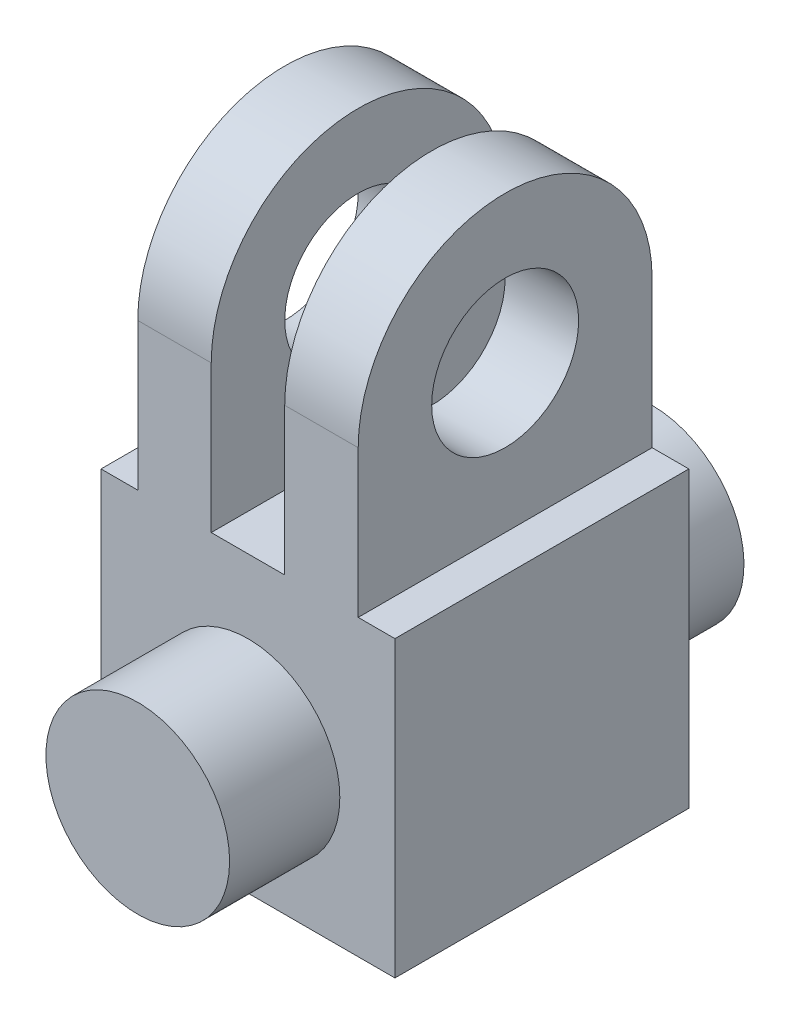
ISO-10303-21;
HEADER;
FILE_DESCRIPTION(('STEP AP214'),'2;1');
FILE_NAME('part.step','',(''),(''),'','','');
FILE_SCHEMA(('AUTOMOTIVE_DESIGN { 1 0 10303 214 1 1 1 1 }'));
ENDSEC;
DATA;
#1=APPLICATION_CONTEXT('core data for automotive mechanical design processes');
#2=APPLICATION_PROTOCOL_DEFINITION('international standard','automotive_design',2000,#1);
#3=PRODUCT_CONTEXT('',#1,'mechanical');
#4=PRODUCT('Part','Part','',(#3));
#5=PRODUCT_RELATED_PRODUCT_CATEGORY('part','',(#4));
#6=PRODUCT_DEFINITION_FORMATION('','',#4);
#7=PRODUCT_DEFINITION_CONTEXT('part definition',#1,'design');
#8=PRODUCT_DEFINITION('design','',#6,#7);
#9=PRODUCT_DEFINITION_SHAPE('','',#8);
#10=(LENGTH_UNIT() NAMED_UNIT(*) SI_UNIT(.MILLI.,.METRE.));
#11=(NAMED_UNIT(*) PLANE_ANGLE_UNIT() SI_UNIT($,.RADIAN.));
#12=(NAMED_UNIT(*) SI_UNIT($,.STERADIAN.) SOLID_ANGLE_UNIT());
#13=UNCERTAINTY_MEASURE_WITH_UNIT(LENGTH_MEASURE(1.E-05),#10,'distance_accuracy_value','');
#14=(GEOMETRIC_REPRESENTATION_CONTEXT(3) GLOBAL_UNCERTAINTY_ASSIGNED_CONTEXT((#13)) GLOBAL_UNIT_ASSIGNED_CONTEXT((#10,
#11,#12)) REPRESENTATION_CONTEXT('',''));
#15=CARTESIAN_POINT('',(0.,0.,0.));
#16=DIRECTION('',(0.,0.,1.));
#17=DIRECTION('',(1.,0.,0.));
#18=AXIS2_PLACEMENT_3D('',#15,#16,#17);
#19=CARTESIAN_POINT('',(-80.,120.,-40.));
#20=DIRECTION('',(1.,0.,0.));
#21=DIRECTION('',(0.,0.,-1.));
#22=AXIS2_PLACEMENT_3D('',#19,#20,#21);
#23=CYLINDRICAL_SURFACE('',#22,40.);
#24=CARTESIAN_POINT('',(-9.99999999999999,120.,-40.));
#25=DIRECTION('',(-1.,0.,0.));
#26=DIRECTION('',(0.,0.,1.));
#27=AXIS2_PLACEMENT_3D('',#24,#25,#26);
#28=CIRCLE('',#27,40.);
#29=CARTESIAN_POINT('',(-10.,120.,0.));
#30=VERTEX_POINT('',#29);
#31=CARTESIAN_POINT('',(-10.,120.,-80.));
#32=VERTEX_POINT('',#31);
#33=EDGE_CURVE('E139',#30,#32,#28,.T.);
#34=ORIENTED_EDGE('',*,*,#33,.T.);
#35=DIRECTION('',(1.,0.,0.));
#36=VECTOR('',#35,1.);
#37=CARTESIAN_POINT('',(-80.,120.,-80.));
#38=LINE('',#37,#36);
#39=CARTESIAN_POINT('',(-30.,120.,-80.));
#40=VERTEX_POINT('',#39);
#41=EDGE_CURVE('E223',#40,#32,#38,.T.);
#42=ORIENTED_EDGE('',*,*,#41,.F.);
#43=CARTESIAN_POINT('',(-30.,120.,-40.));
#44=DIRECTION('',(1.,0.,0.));
#45=DIRECTION('',(0.,0.,-1.));
#46=AXIS2_PLACEMENT_3D('',#43,#44,#45);
#47=CIRCLE('',#46,40.);
#48=CARTESIAN_POINT('',(-30.,120.,0.));
#49=VERTEX_POINT('',#48);
#50=EDGE_CURVE('E180',#40,#49,#47,.T.);
#51=ORIENTED_EDGE('',*,*,#50,.T.);
#52=DIRECTION('',(1.,0.,0.));
#53=VECTOR('',#52,1.);
#54=CARTESIAN_POINT('',(-80.,120.,0.));
#55=LINE('',#54,#53);
#56=EDGE_CURVE('E42',#49,#30,#55,.T.);
#57=ORIENTED_EDGE('',*,*,#56,.T.);
#58=EDGE_LOOP('',(#34,#42,#51,#57));
#59=FACE_BOUND('',#58,.T.);
#60=ADVANCED_FACE('F33',(#59),#23,.T.);
#61=CARTESIAN_POINT('',(-80.,120.,0.));
#62=DIRECTION('',(0.,0.,1.));
#63=DIRECTION('',(0.,-1.,0.));
#64=AXIS2_PLACEMENT_3D('',#61,#62,#63);
#65=PLANE('',#64);
#66=CARTESIAN_POINT('',(-40.,35.,0.));
#67=DIRECTION('',(0.,0.,1.));
#68=DIRECTION('',(1.,0.,0.));
#69=AXIS2_PLACEMENT_3D('',#66,#67,#68);
#70=CIRCLE('',#69,25.);
#71=CARTESIAN_POINT('',(-15.,35.,0.));
#72=VERTEX_POINT('',#71);
#73=EDGE_CURVE('E240',#72,#72,#70,.T.);
#74=ORIENTED_EDGE('',*,*,#73,.F.);
#75=EDGE_LOOP('',(#74));
#76=FACE_BOUND('',#75,.T.);
#77=DIRECTION('',(0.,-1.,0.));
#78=VECTOR('',#77,1.);
#79=CARTESIAN_POINT('',(-10.,80.,0.));
#80=LINE('',#79,#78);
#81=CARTESIAN_POINT('',(-10.,80.,0.));
#82=VERTEX_POINT('',#81);
#83=EDGE_CURVE('E136',#30,#82,#80,.T.);
#84=ORIENTED_EDGE('',*,*,#83,.F.);
#85=ORIENTED_EDGE('',*,*,#56,.F.);
#86=DIRECTION('',(0.,1.,0.));
#87=VECTOR('',#86,1.);
#88=CARTESIAN_POINT('',(-30.,80.,0.));
#89=LINE('',#88,#87);
#90=CARTESIAN_POINT('',(-30.,80.,0.));
#91=VERTEX_POINT('',#90);
#92=EDGE_CURVE('E190',#91,#49,#89,.T.);
#93=ORIENTED_EDGE('',*,*,#92,.F.);
#94=DIRECTION('',(1.,0.,0.));
#95=VECTOR('',#94,1.);
#96=CARTESIAN_POINT('',(-50.,80.,0.));
#97=LINE('',#96,#95);
#98=CARTESIAN_POINT('',(-50.,80.,0.));
#99=VERTEX_POINT('',#98);
#100=EDGE_CURVE('E195',#99,#91,#97,.T.);
#101=ORIENTED_EDGE('',*,*,#100,.F.);
#102=DIRECTION('',(0.,-1.,0.));
#103=VECTOR('',#102,1.);
#104=CARTESIAN_POINT('',(-50.,160.,0.));
#105=LINE('',#104,#103);
#106=CARTESIAN_POINT('',(-50.,120.,0.));
#107=VERTEX_POINT('',#106);
#108=EDGE_CURVE('E192',#107,#99,#105,.T.);
#109=ORIENTED_EDGE('',*,*,#108,.F.);
#110=CARTESIAN_POINT('',(-70.,120.,0.));
#111=VERTEX_POINT('',#110);
#112=EDGE_CURVE('E11',#111,#107,#55,.T.);
#113=ORIENTED_EDGE('',*,*,#112,.F.);
#114=DIRECTION('',(0.,1.,0.));
#115=VECTOR('',#114,1.);
#116=CARTESIAN_POINT('',(-70.,80.,0.));
#117=LINE('',#116,#115);
#118=CARTESIAN_POINT('',(-70.,80.,0.));
#119=VERTEX_POINT('',#118);
#120=EDGE_CURVE('E166',#119,#111,#117,.T.);
#121=ORIENTED_EDGE('',*,*,#120,.F.);
#122=DIRECTION('',(1.,0.,0.));
#123=VECTOR('',#122,1.);
#124=CARTESIAN_POINT('',(-80.,80.,0.));
#125=LINE('',#124,#123);
#126=CARTESIAN_POINT('',(-80.,80.,0.));
#127=VERTEX_POINT('',#126);
#128=EDGE_CURVE('E163',#127,#119,#125,.T.);
#129=ORIENTED_EDGE('',*,*,#128,.F.);
#130=DIRECTION('',(0.,-1.,0.));
#131=VECTOR('',#130,1.);
#132=CARTESIAN_POINT('',(-80.,120.,0.));
#133=LINE('',#132,#131);
#134=CARTESIAN_POINT('',(-80.,0.,0.));
#135=VERTEX_POINT('',#134);
#136=EDGE_CURVE('E207',#127,#135,#133,.T.);
#137=ORIENTED_EDGE('',*,*,#136,.T.);
#138=DIRECTION('',(1.,0.,0.));
#139=VECTOR('',#138,1.);
#140=CARTESIAN_POINT('',(-80.,0.,0.));
#141=LINE('',#140,#139);
#142=CARTESIAN_POINT('',(0.,0.,0.));
#143=VERTEX_POINT('',#142);
#144=EDGE_CURVE('E37',#135,#143,#141,.T.);
#145=ORIENTED_EDGE('',*,*,#144,.T.);
#146=DIRECTION('',(0.,-1.,0.));
#147=VECTOR('',#146,1.);
#148=CARTESIAN_POINT('',(0.,120.,0.));
#149=LINE('',#148,#147);
#150=CARTESIAN_POINT('',(0.,80.,0.));
#151=VERTEX_POINT('',#150);
#152=EDGE_CURVE('E146',#151,#143,#149,.T.);
#153=ORIENTED_EDGE('',*,*,#152,.F.);
#154=DIRECTION('',(1.,0.,0.));
#155=VECTOR('',#154,1.);
#156=CARTESIAN_POINT('',(0.,80.,0.));
#157=LINE('',#156,#155);
#158=EDGE_CURVE('E127',#82,#151,#157,.T.);
#159=ORIENTED_EDGE('',*,*,#158,.F.);
#160=EDGE_LOOP('',(#84,#85,#93,#101,#109,#113,#121,#129,#137,#145,#153,#159));
#161=FACE_BOUND('',#160,.T.);
#162=ADVANCED_FACE('F35',(#76,#161),#65,.T.);
#163=CARTESIAN_POINT('',(-70.,120.,-40.));
#164=DIRECTION('',(1.,0.,0.));
#165=DIRECTION('',(0.,0.,-1.));
#166=AXIS2_PLACEMENT_3D('',#163,#164,#165);
#167=CIRCLE('',#166,40.);
#168=CARTESIAN_POINT('',(-70.,120.,-80.));
#169=VERTEX_POINT('',#168);
#170=EDGE_CURVE('E156',#169,#111,#167,.T.);
#171=ORIENTED_EDGE('',*,*,#170,.T.);
#172=ORIENTED_EDGE('',*,*,#112,.T.);
#173=CARTESIAN_POINT('',(-50.,120.,-40.));
#174=DIRECTION('',(-1.,0.,0.));
#175=DIRECTION('',(0.,-1.,0.));
#176=AXIS2_PLACEMENT_3D('',#173,#174,#175);
#177=CIRCLE('',#176,40.);
#178=CARTESIAN_POINT('',(-50.,120.,-80.));
#179=VERTEX_POINT('',#178);
#180=EDGE_CURVE('E176',#107,#179,#177,.T.);
#181=ORIENTED_EDGE('',*,*,#180,.T.);
#182=EDGE_CURVE('E222',#169,#179,#38,.T.);
#183=ORIENTED_EDGE('',*,*,#182,.F.);
#184=EDGE_LOOP('',(#171,#172,#181,#183));
#185=FACE_BOUND('',#184,.T.);
#186=ADVANCED_FACE('F262',(#185),#23,.T.);
#187=CARTESIAN_POINT('',(-80.,0.,-80.));
#188=DIRECTION('',(0.,0.,-1.));
#189=DIRECTION('',(0.,1.,0.));
#190=AXIS2_PLACEMENT_3D('',#187,#188,#189);
#191=PLANE('',#190);
#192=CARTESIAN_POINT('',(-40.,35.,-80.));
#193=DIRECTION('',(0.,0.,-1.));
#194=DIRECTION('',(0.,1.,0.));
#195=AXIS2_PLACEMENT_3D('',#192,#193,#194);
#196=CIRCLE('',#195,25.);
#197=CARTESIAN_POINT('',(-40.,60.,-80.));
#198=VERTEX_POINT('',#197);
#199=EDGE_CURVE('E246',#198,#198,#196,.T.);
#200=ORIENTED_EDGE('',*,*,#199,.F.);
#201=EDGE_LOOP('',(#200));
#202=FACE_BOUND('',#201,.T.);
#203=DIRECTION('',(0.,-1.,0.));
#204=VECTOR('',#203,1.);
#205=CARTESIAN_POINT('',(-10.,80.,-80.));
#206=LINE('',#205,#204);
#207=CARTESIAN_POINT('',(-10.,80.,-80.));
#208=VERTEX_POINT('',#207);
#209=EDGE_CURVE('E154',#32,#208,#206,.T.);
#210=ORIENTED_EDGE('',*,*,#209,.T.);
#211=DIRECTION('',(1.,0.,0.));
#212=VECTOR('',#211,1.);
#213=CARTESIAN_POINT('',(0.,80.,-80.));
#214=LINE('',#213,#212);
#215=CARTESIAN_POINT('',(0.,80.,-80.));
#216=VERTEX_POINT('',#215);
#217=EDGE_CURVE('E130',#208,#216,#214,.T.);
#218=ORIENTED_EDGE('',*,*,#217,.T.);
#219=DIRECTION('',(0.,1.,0.));
#220=VECTOR('',#219,1.);
#221=CARTESIAN_POINT('',(0.,0.,-80.));
#222=LINE('',#221,#220);
#223=CARTESIAN_POINT('',(0.,0.,-80.));
#224=VERTEX_POINT('',#223);
#225=EDGE_CURVE('E210',#224,#216,#222,.T.);
#226=ORIENTED_EDGE('',*,*,#225,.F.);
#227=DIRECTION('',(1.,0.,0.));
#228=VECTOR('',#227,1.);
#229=CARTESIAN_POINT('',(-80.,0.,-80.));
#230=LINE('',#229,#228);
#231=CARTESIAN_POINT('',(-80.,0.,-80.));
#232=VERTEX_POINT('',#231);
#233=EDGE_CURVE('E225',#232,#224,#230,.T.);
#234=ORIENTED_EDGE('',*,*,#233,.F.);
#235=DIRECTION('',(0.,1.,0.));
#236=VECTOR('',#235,1.);
#237=CARTESIAN_POINT('',(-80.,0.,-80.));
#238=LINE('',#237,#236);
#239=CARTESIAN_POINT('',(-80.,80.,-80.));
#240=VERTEX_POINT('',#239);
#241=EDGE_CURVE('E213',#232,#240,#238,.T.);
#242=ORIENTED_EDGE('',*,*,#241,.T.);
#243=DIRECTION('',(1.,0.,0.));
#244=VECTOR('',#243,1.);
#245=CARTESIAN_POINT('',(-80.,80.,-80.));
#246=LINE('',#245,#244);
#247=CARTESIAN_POINT('',(-70.,80.,-80.));
#248=VERTEX_POINT('',#247);
#249=EDGE_CURVE('E58',#240,#248,#246,.T.);
#250=ORIENTED_EDGE('',*,*,#249,.T.);
#251=DIRECTION('',(0.,1.,0.));
#252=VECTOR('',#251,1.);
#253=CARTESIAN_POINT('',(-70.,80.,-80.));
#254=LINE('',#253,#252);
#255=EDGE_CURVE('E159',#248,#169,#254,.T.);
#256=ORIENTED_EDGE('',*,*,#255,.T.);
#257=ORIENTED_EDGE('',*,*,#182,.T.);
#258=DIRECTION('',(0.,-1.,0.));
#259=VECTOR('',#258,1.);
#260=CARTESIAN_POINT('',(-50.,160.,-80.));
#261=LINE('',#260,#259);
#262=CARTESIAN_POINT('',(-50.,80.,-80.));
#263=VERTEX_POINT('',#262);
#264=EDGE_CURVE('E186',#179,#263,#261,.T.);
#265=ORIENTED_EDGE('',*,*,#264,.T.);
#266=DIRECTION('',(1.,0.,0.));
#267=VECTOR('',#266,1.);
#268=CARTESIAN_POINT('',(-50.,80.,-80.));
#269=LINE('',#268,#267);
#270=CARTESIAN_POINT('',(-30.,80.,-80.));
#271=VERTEX_POINT('',#270);
#272=EDGE_CURVE('E179',#263,#271,#269,.T.);
#273=ORIENTED_EDGE('',*,*,#272,.T.);
#274=DIRECTION('',(0.,1.,0.));
#275=VECTOR('',#274,1.);
#276=CARTESIAN_POINT('',(-30.,80.,-80.));
#277=LINE('',#276,#275);
#278=EDGE_CURVE('E50',#271,#40,#277,.T.);
#279=ORIENTED_EDGE('',*,*,#278,.T.);
#280=ORIENTED_EDGE('',*,*,#41,.T.);
#281=EDGE_LOOP('',(#210,#218,#226,#234,#242,#250,#256,#257,#265,#273,#279,#280));
#282=FACE_BOUND('',#281,.T.);
#283=ADVANCED_FACE('F237',(#202,#282),#191,.T.);
#284=CARTESIAN_POINT('',(-80.,0.,0.));
#285=DIRECTION('',(0.,-1.,0.));
#286=DIRECTION('',(0.,0.,-1.));
#287=AXIS2_PLACEMENT_3D('',#284,#285,#286);
#288=PLANE('',#287);
#289=DIRECTION('',(0.,0.,-1.));
#290=VECTOR('',#289,1.);
#291=CARTESIAN_POINT('',(0.,0.,0.));
#292=LINE('',#291,#290);
#293=EDGE_CURVE('E217',#143,#224,#292,.T.);
#294=ORIENTED_EDGE('',*,*,#293,.F.);
#295=ORIENTED_EDGE('',*,*,#144,.F.);
#296=DIRECTION('',(0.,0.,-1.));
#297=VECTOR('',#296,1.);
#298=CARTESIAN_POINT('',(-80.,0.,0.));
#299=LINE('',#298,#297);
#300=EDGE_CURVE('E209',#135,#232,#299,.T.);
#301=ORIENTED_EDGE('',*,*,#300,.T.);
#302=ORIENTED_EDGE('',*,*,#233,.T.);
#303=EDGE_LOOP('',(#294,#295,#301,#302));
#304=FACE_BOUND('',#303,.T.);
#305=ADVANCED_FACE('F233',(#304),#288,.T.);
#306=CARTESIAN_POINT('',(-80.,120.,-40.));
#307=DIRECTION('',(1.,0.,0.));
#308=DIRECTION('',(0.,0.,-1.));
#309=AXIS2_PLACEMENT_3D('',#306,#307,#308);
#310=PLANE('',#309);
#311=ORIENTED_EDGE('',*,*,#136,.F.);
#312=DIRECTION('',(0.,0.,1.));
#313=VECTOR('',#312,1.);
#314=CARTESIAN_POINT('',(-80.,80.,-80.001));
#315=LINE('',#314,#313);
#316=EDGE_CURVE('E168',#240,#127,#315,.T.);
#317=ORIENTED_EDGE('',*,*,#316,.F.);
#318=ORIENTED_EDGE('',*,*,#241,.F.);
#319=ORIENTED_EDGE('',*,*,#300,.F.);
#320=EDGE_LOOP('',(#311,#317,#318,#319));
#321=FACE_BOUND('',#320,.T.);
#322=ADVANCED_FACE('F268',(#321),#310,.F.);
#323=CARTESIAN_POINT('',(0.,120.,-40.));
#324=DIRECTION('',(1.,0.,0.));
#325=DIRECTION('',(0.,0.,-1.));
#326=AXIS2_PLACEMENT_3D('',#323,#324,#325);
#327=PLANE('',#326);
#328=DIRECTION('',(0.,0.,1.));
#329=VECTOR('',#328,1.);
#330=CARTESIAN_POINT('',(0.,80.,-80.001));
#331=LINE('',#330,#329);
#332=EDGE_CURVE('E133',#216,#151,#331,.T.);
#333=ORIENTED_EDGE('',*,*,#332,.T.);
#334=ORIENTED_EDGE('',*,*,#152,.T.);
#335=ORIENTED_EDGE('',*,*,#293,.T.);
#336=ORIENTED_EDGE('',*,*,#225,.T.);
#337=EDGE_LOOP('',(#333,#334,#335,#336));
#338=FACE_BOUND('',#337,.T.);
#339=ADVANCED_FACE('F235',(#338),#327,.T.);
#340=CARTESIAN_POINT('',(-30.,80.,-80.001));
#341=DIRECTION('',(1.,0.,0.));
#342=DIRECTION('',(0.,0.,-1.));
#343=AXIS2_PLACEMENT_3D('',#340,#341,#342);
#344=PLANE('',#343);
#345=CARTESIAN_POINT('',(-30.,120.,-40.));
#346=DIRECTION('',(1.,0.,0.));
#347=DIRECTION('',(0.,0.,-1.));
#348=AXIS2_PLACEMENT_3D('',#345,#346,#347);
#349=CIRCLE('',#348,20.);
#350=CARTESIAN_POINT('',(-30.,120.,-60.));
#351=VERTEX_POINT('',#350);
#352=EDGE_CURVE('E160',#351,#351,#349,.T.);
#353=ORIENTED_EDGE('',*,*,#352,.T.);
#354=EDGE_LOOP('',(#353));
#355=FACE_BOUND('',#354,.T.);
#356=ORIENTED_EDGE('',*,*,#50,.F.);
#357=ORIENTED_EDGE('',*,*,#278,.F.);
#358=DIRECTION('',(0.,0.,1.));
#359=VECTOR('',#358,1.);
#360=CARTESIAN_POINT('',(-30.,80.,-80.001));
#361=LINE('',#360,#359);
#362=EDGE_CURVE('E199',#271,#91,#361,.T.);
#363=ORIENTED_EDGE('',*,*,#362,.T.);
#364=ORIENTED_EDGE('',*,*,#92,.T.);
#365=EDGE_LOOP('',(#356,#357,#363,#364));
#366=FACE_BOUND('',#365,.T.);
#367=ADVANCED_FACE('F280',(#355,#366),#344,.F.);
#368=CARTESIAN_POINT('',(-50.,160.,-80.001));
#369=DIRECTION('',(-1.,0.,0.));
#370=DIRECTION('',(0.,-1.,0.));
#371=AXIS2_PLACEMENT_3D('',#368,#369,#370);
#372=PLANE('',#371);
#373=CARTESIAN_POINT('',(-50.,120.,-40.));
#374=DIRECTION('',(-1.,0.,0.));
#375=DIRECTION('',(0.,-1.,0.));
#376=AXIS2_PLACEMENT_3D('',#373,#374,#375);
#377=CIRCLE('',#376,20.);
#378=CARTESIAN_POINT('',(-50.,100.,-40.));
#379=VERTEX_POINT('',#378);
#380=EDGE_CURVE('E201',#379,#379,#377,.T.);
#381=ORIENTED_EDGE('',*,*,#380,.T.);
#382=EDGE_LOOP('',(#381));
#383=FACE_BOUND('',#382,.T.);
#384=ORIENTED_EDGE('',*,*,#108,.T.);
#385=DIRECTION('',(0.,0.,1.));
#386=VECTOR('',#385,1.);
#387=CARTESIAN_POINT('',(-50.,80.,-80.001));
#388=LINE('',#387,#386);
#389=EDGE_CURVE('E198',#263,#99,#388,.T.);
#390=ORIENTED_EDGE('',*,*,#389,.F.);
#391=ORIENTED_EDGE('',*,*,#264,.F.);
#392=ORIENTED_EDGE('',*,*,#180,.F.);
#393=EDGE_LOOP('',(#384,#390,#391,#392));
#394=FACE_BOUND('',#393,.T.);
#395=ADVANCED_FACE('F292',(#383,#394),#372,.F.);
#396=CARTESIAN_POINT('',(-50.,80.,-80.001));
#397=DIRECTION('',(0.,-1.,0.));
#398=DIRECTION('',(0.,0.,-1.));
#399=AXIS2_PLACEMENT_3D('',#396,#397,#398);
#400=PLANE('',#399);
#401=ORIENTED_EDGE('',*,*,#389,.T.);
#402=ORIENTED_EDGE('',*,*,#100,.T.);
#403=ORIENTED_EDGE('',*,*,#362,.F.);
#404=ORIENTED_EDGE('',*,*,#272,.F.);
#405=EDGE_LOOP('',(#401,#402,#403,#404));
#406=FACE_BOUND('',#405,.T.);
#407=ADVANCED_FACE('F296',(#406),#400,.F.);
#408=CARTESIAN_POINT('',(-80.,120.,-40.));
#409=DIRECTION('',(1.,0.,0.));
#410=DIRECTION('',(0.,0.,-1.));
#411=AXIS2_PLACEMENT_3D('',#408,#409,#410);
#412=CYLINDRICAL_SURFACE('',#411,20.);
#413=CARTESIAN_POINT('',(-9.99999999999999,120.,-40.));
#414=DIRECTION('',(-1.,0.,0.));
#415=DIRECTION('',(0.,0.,1.));
#416=AXIS2_PLACEMENT_3D('',#413,#414,#415);
#417=CIRCLE('',#416,20.);
#418=CARTESIAN_POINT('',(-9.99999999999999,120.,-20.));
#419=VERTEX_POINT('',#418);
#420=EDGE_CURVE('E150',#419,#419,#417,.T.);
#421=ORIENTED_EDGE('',*,*,#420,.F.);
#422=EDGE_LOOP('',(#421));
#423=FACE_BOUND('',#422,.T.);
#424=ORIENTED_EDGE('',*,*,#352,.F.);
#425=EDGE_LOOP('',(#424));
#426=FACE_BOUND('',#425,.T.);
#427=ADVANCED_FACE('F289',(#423,#426),#412,.F.);
#428=CARTESIAN_POINT('',(-70.,80.,-80.001));
#429=DIRECTION('',(1.,0.,0.));
#430=DIRECTION('',(0.,0.,-1.));
#431=AXIS2_PLACEMENT_3D('',#428,#429,#430);
#432=PLANE('',#431);
#433=CARTESIAN_POINT('',(-70.,120.,-40.));
#434=DIRECTION('',(1.,0.,0.));
#435=DIRECTION('',(0.,0.,-1.));
#436=AXIS2_PLACEMENT_3D('',#433,#434,#435);
#437=CIRCLE('',#436,20.);
#438=CARTESIAN_POINT('',(-70.,120.,-60.));
#439=VERTEX_POINT('',#438);
#440=EDGE_CURVE('E173',#439,#439,#437,.T.);
#441=ORIENTED_EDGE('',*,*,#440,.T.);
#442=EDGE_LOOP('',(#441));
#443=FACE_BOUND('',#442,.T.);
#444=ORIENTED_EDGE('',*,*,#170,.F.);
#445=ORIENTED_EDGE('',*,*,#255,.F.);
#446=DIRECTION('',(0.,0.,1.));
#447=VECTOR('',#446,1.);
#448=CARTESIAN_POINT('',(-70.,80.,-80.001));
#449=LINE('',#448,#447);
#450=EDGE_CURVE('E169',#248,#119,#449,.T.);
#451=ORIENTED_EDGE('',*,*,#450,.T.);
#452=ORIENTED_EDGE('',*,*,#120,.T.);
#453=EDGE_LOOP('',(#444,#445,#451,#452));
#454=FACE_BOUND('',#453,.T.);
#455=ADVANCED_FACE('F304',(#443,#454),#432,.F.);
#456=CARTESIAN_POINT('',(-80.,80.,-80.001));
#457=DIRECTION('',(0.,-1.,0.));
#458=DIRECTION('',(0.,0.,-1.));
#459=AXIS2_PLACEMENT_3D('',#456,#457,#458);
#460=PLANE('',#459);
#461=ORIENTED_EDGE('',*,*,#316,.T.);
#462=ORIENTED_EDGE('',*,*,#128,.T.);
#463=ORIENTED_EDGE('',*,*,#450,.F.);
#464=ORIENTED_EDGE('',*,*,#249,.F.);
#465=EDGE_LOOP('',(#461,#462,#463,#464));
#466=FACE_BOUND('',#465,.T.);
#467=ADVANCED_FACE('F301',(#466),#460,.F.);
#468=CARTESIAN_POINT('',(-10.,80.,-80.001));
#469=DIRECTION('',(-1.,0.,0.));
#470=DIRECTION('',(0.,0.,1.));
#471=AXIS2_PLACEMENT_3D('',#468,#469,#470);
#472=PLANE('',#471);
#473=ORIENTED_EDGE('',*,*,#420,.T.);
#474=EDGE_LOOP('',(#473));
#475=FACE_BOUND('',#474,.T.);
#476=ORIENTED_EDGE('',*,*,#83,.T.);
#477=DIRECTION('',(0.,0.,1.));
#478=VECTOR('',#477,1.);
#479=CARTESIAN_POINT('',(-10.,80.,-80.001));
#480=LINE('',#479,#478);
#481=EDGE_CURVE('E123',#208,#82,#480,.T.);
#482=ORIENTED_EDGE('',*,*,#481,.F.);
#483=ORIENTED_EDGE('',*,*,#209,.F.);
#484=ORIENTED_EDGE('',*,*,#33,.F.);
#485=EDGE_LOOP('',(#476,#482,#483,#484));
#486=FACE_BOUND('',#485,.T.);
#487=ADVANCED_FACE('F137',(#475,#486),#472,.F.);
#488=CARTESIAN_POINT('',(0.,80.,-80.001));
#489=DIRECTION('',(0.,-1.,0.));
#490=DIRECTION('',(0.,0.,-1.));
#491=AXIS2_PLACEMENT_3D('',#488,#489,#490);
#492=PLANE('',#491);
#493=ORIENTED_EDGE('',*,*,#481,.T.);
#494=ORIENTED_EDGE('',*,*,#158,.T.);
#495=ORIENTED_EDGE('',*,*,#332,.F.);
#496=ORIENTED_EDGE('',*,*,#217,.F.);
#497=EDGE_LOOP('',(#493,#494,#495,#496));
#498=FACE_BOUND('',#497,.T.);
#499=ADVANCED_FACE('F125',(#498),#492,.F.);
#500=ORIENTED_EDGE('',*,*,#440,.F.);
#501=EDGE_LOOP('',(#500));
#502=FACE_BOUND('',#501,.T.);
#503=ORIENTED_EDGE('',*,*,#380,.F.);
#504=EDGE_LOOP('',(#503));
#505=FACE_BOUND('',#504,.T.);
#506=ADVANCED_FACE('F284',(#502,#505),#412,.F.);
#507=CARTESIAN_POINT('',(-40.,35.,30.));
#508=DIRECTION('',(0.,0.,-1.));
#509=DIRECTION('',(-1.,0.,0.));
#510=AXIS2_PLACEMENT_3D('',#507,#508,#509);
#511=CYLINDRICAL_SURFACE('',#510,25.);
#512=CARTESIAN_POINT('',(-40.,35.,30.));
#513=DIRECTION('',(0.,0.,1.));
#514=DIRECTION('',(1.,0.,0.));
#515=AXIS2_PLACEMENT_3D('',#512,#513,#514);
#516=CIRCLE('',#515,25.);
#517=CARTESIAN_POINT('',(-15.,35.,30.));
#518=VERTEX_POINT('',#517);
#519=EDGE_CURVE('E183',#518,#518,#516,.T.);
#520=ORIENTED_EDGE('',*,*,#519,.F.);
#521=EDGE_LOOP('',(#520));
#522=FACE_BOUND('',#521,.T.);
#523=ORIENTED_EDGE('',*,*,#73,.T.);
#524=EDGE_LOOP('',(#523));
#525=FACE_BOUND('',#524,.T.);
#526=ADVANCED_FACE('F287',(#522,#525),#511,.T.);
#527=CARTESIAN_POINT('',(-40.,35.,30.));
#528=DIRECTION('',(0.,0.,1.));
#529=DIRECTION('',(1.,0.,0.));
#530=AXIS2_PLACEMENT_3D('',#527,#528,#529);
#531=PLANE('',#530);
#532=ORIENTED_EDGE('',*,*,#519,.T.);
#533=EDGE_LOOP('',(#532));
#534=FACE_BOUND('',#533,.T.);
#535=ADVANCED_FACE('F257',(#534),#531,.T.);
#536=CARTESIAN_POINT('',(-40.,35.,-110.));
#537=DIRECTION('',(0.,0.,1.));
#538=DIRECTION('',(0.,-1.,0.));
#539=AXIS2_PLACEMENT_3D('',#536,#537,#538);
#540=CYLINDRICAL_SURFACE('',#539,25.);
#541=CARTESIAN_POINT('',(-40.,35.,-110.));
#542=DIRECTION('',(0.,0.,-1.));
#543=DIRECTION('',(0.,1.,0.));
#544=AXIS2_PLACEMENT_3D('',#541,#542,#543);
#545=CIRCLE('',#544,25.);
#546=CARTESIAN_POINT('',(-40.,60.,-110.));
#547=VERTEX_POINT('',#546);
#548=EDGE_CURVE('E243',#547,#547,#545,.T.);
#549=ORIENTED_EDGE('',*,*,#548,.F.);
#550=EDGE_LOOP('',(#549));
#551=FACE_BOUND('',#550,.T.);
#552=ORIENTED_EDGE('',*,*,#199,.T.);
#553=EDGE_LOOP('',(#552));
#554=FACE_BOUND('',#553,.T.);
#555=ADVANCED_FACE('F254',(#551,#554),#540,.T.);
#556=CARTESIAN_POINT('',(-40.,35.,-110.));
#557=DIRECTION('',(0.,0.,-1.));
#558=DIRECTION('',(0.,1.,0.));
#559=AXIS2_PLACEMENT_3D('',#556,#557,#558);
#560=PLANE('',#559);
#561=ORIENTED_EDGE('',*,*,#548,.T.);
#562=EDGE_LOOP('',(#561));
#563=FACE_BOUND('',#562,.T.);
#564=ADVANCED_FACE('F252',(#563),#560,.T.);
#565=CLOSED_SHELL('',(#60,#162,#186,#283,#305,#322,#339,#367,#395,#407,#427,#455,#467,#487,#499,
#506,#526,#535,#555,#564));
#566=MANIFOLD_SOLID_BREP('B2',#565);
#567=ADVANCED_BREP_SHAPE_REPRESENTATION('',(#18,#566),#14);
#568=SHAPE_DEFINITION_REPRESENTATION(#9,#567);
ENDSEC;
END-ISO-10303-21;
